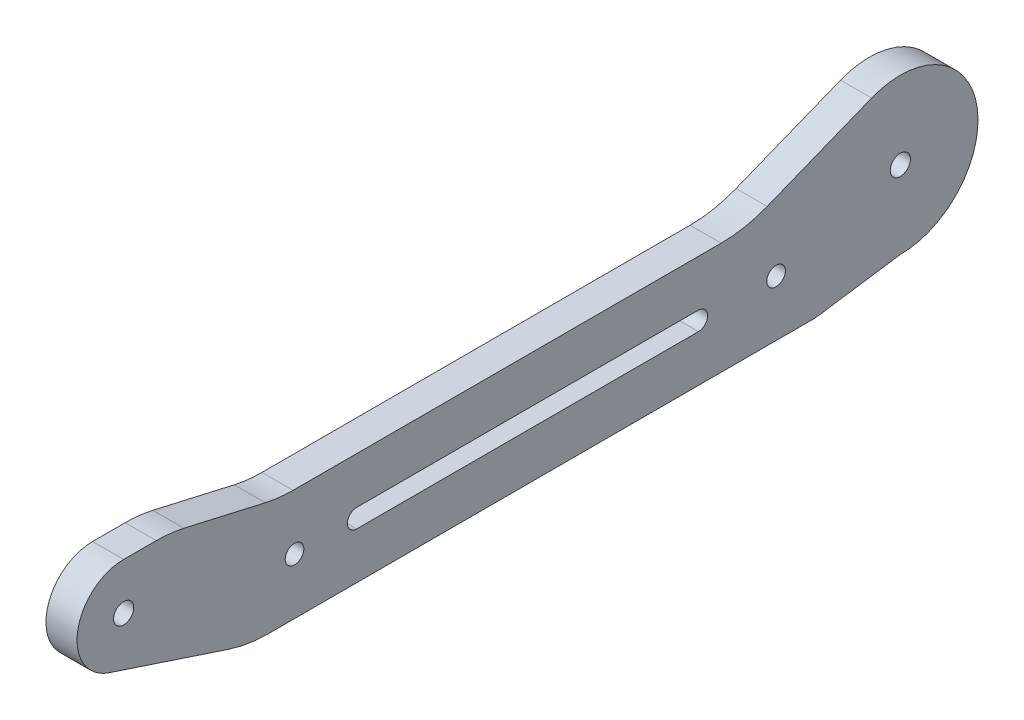
ISO-10303-21;
HEADER;
FILE_DESCRIPTION(('STEP AP214'),'2;1');
FILE_NAME('part.step','',(''),(''),'','','');
FILE_SCHEMA(('AUTOMOTIVE_DESIGN { 1 0 10303 214 1 1 1 1 }'));
ENDSEC;
DATA;
#1=APPLICATION_CONTEXT('core data for automotive mechanical design processes');
#2=APPLICATION_PROTOCOL_DEFINITION('international standard','automotive_design',2000,#1);
#3=PRODUCT_CONTEXT('',#1,'mechanical');
#4=PRODUCT('Part','Part','',(#3));
#5=PRODUCT_RELATED_PRODUCT_CATEGORY('part','',(#4));
#6=PRODUCT_DEFINITION_FORMATION('','',#4);
#7=PRODUCT_DEFINITION_CONTEXT('part definition',#1,'design');
#8=PRODUCT_DEFINITION('design','',#6,#7);
#9=PRODUCT_DEFINITION_SHAPE('','',#8);
#10=(LENGTH_UNIT() NAMED_UNIT(*) SI_UNIT(.MILLI.,.METRE.));
#11=(NAMED_UNIT(*) PLANE_ANGLE_UNIT() SI_UNIT($,.RADIAN.));
#12=(NAMED_UNIT(*) SI_UNIT($,.STERADIAN.) SOLID_ANGLE_UNIT());
#13=UNCERTAINTY_MEASURE_WITH_UNIT(LENGTH_MEASURE(1.E-05),#10,'distance_accuracy_value','');
#14=(GEOMETRIC_REPRESENTATION_CONTEXT(3) GLOBAL_UNCERTAINTY_ASSIGNED_CONTEXT((#13)) GLOBAL_UNIT_ASSIGNED_CONTEXT((#10,
#11,#12)) REPRESENTATION_CONTEXT('',''));
#15=CARTESIAN_POINT('',(0.,0.,0.));
#16=DIRECTION('',(0.,0.,1.));
#17=DIRECTION('',(1.,0.,0.));
#18=AXIS2_PLACEMENT_3D('',#15,#16,#17);
#19=CARTESIAN_POINT('',(2.5,0.,0.));
#20=DIRECTION('',(1.,0.,0.));
#21=DIRECTION('',(0.,0.,-1.));
#22=AXIS2_PLACEMENT_3D('',#19,#20,#21);
#23=PLANE('',#22);
#24=CARTESIAN_POINT('',(2.5,0.,125.));
#25=DIRECTION('',(-1.,0.,0.));
#26=DIRECTION('',(0.,0.,1.));
#27=AXIS2_PLACEMENT_3D('',#24,#25,#26);
#28=CIRCLE('',#27,1.62500000000002);
#29=CARTESIAN_POINT('',(2.5,0.,126.625));
#30=VERTEX_POINT('',#29);
#31=EDGE_CURVE('E232',#30,#30,#28,.T.);
#32=ORIENTED_EDGE('',*,*,#31,.T.);
#33=EDGE_LOOP('',(#32));
#34=FACE_BOUND('',#33,.T.);
#35=CARTESIAN_POINT('',(2.5,-5.50000000000001,97.5));
#36=DIRECTION('',(-1.,0.,0.));
#37=DIRECTION('',(0.,0.,1.));
#38=AXIS2_PLACEMENT_3D('',#35,#36,#37);
#39=CIRCLE('',#38,1.5);
#40=CARTESIAN_POINT('',(2.5,-5.50000000000001,99.));
#41=VERTEX_POINT('',#40);
#42=EDGE_CURVE('E235',#41,#41,#39,.T.);
#43=ORIENTED_EDGE('',*,*,#42,.T.);
#44=EDGE_LOOP('',(#43));
#45=FACE_BOUND('',#44,.T.);
#46=CARTESIAN_POINT('',(2.5,-5.5,20.));
#47=DIRECTION('',(-1.,0.,0.));
#48=DIRECTION('',(0.,0.,1.));
#49=AXIS2_PLACEMENT_3D('',#46,#47,#48);
#50=CIRCLE('',#49,1.5);
#51=CARTESIAN_POINT('',(2.5,-5.5,21.5));
#52=VERTEX_POINT('',#51);
#53=EDGE_CURVE('E238',#52,#52,#50,.T.);
#54=ORIENTED_EDGE('',*,*,#53,.T.);
#55=EDGE_LOOP('',(#54));
#56=FACE_BOUND('',#55,.T.);
#57=CARTESIAN_POINT('',(2.5,-5.5,87.5));
#58=DIRECTION('',(-1.,0.,0.));
#59=DIRECTION('',(0.,0.,1.));
#60=AXIS2_PLACEMENT_3D('',#57,#58,#59);
#61=CIRCLE('',#60,1.5);
#62=CARTESIAN_POINT('',(2.5,-7.,87.5));
#63=VERTEX_POINT('',#62);
#64=CARTESIAN_POINT('',(2.5,-4.,87.5));
#65=VERTEX_POINT('',#64);
#66=EDGE_CURVE('E245',#63,#65,#61,.T.);
#67=ORIENTED_EDGE('',*,*,#66,.T.);
#68=DIRECTION('',(0.,0.,1.));
#69=VECTOR('',#68,1.);
#70=CARTESIAN_POINT('',(2.5,-3.99999999999998,0.));
#71=LINE('',#70,#69);
#72=CARTESIAN_POINT('',(2.5,-3.99999999999999,32.5));
#73=VERTEX_POINT('',#72);
#74=EDGE_CURVE('E164',#65,#73,#71,.F.);
#75=ORIENTED_EDGE('',*,*,#74,.T.);
#76=CARTESIAN_POINT('',(2.5,-5.49999999999999,32.5));
#77=DIRECTION('',(-1.,0.,0.));
#78=DIRECTION('',(0.,0.,1.));
#79=AXIS2_PLACEMENT_3D('',#76,#77,#78);
#80=CIRCLE('',#79,1.5);
#81=CARTESIAN_POINT('',(2.5,-6.99999999999999,32.5));
#82=VERTEX_POINT('',#81);
#83=EDGE_CURVE('E242',#73,#82,#80,.T.);
#84=ORIENTED_EDGE('',*,*,#83,.T.);
#85=DIRECTION('',(0.,0.,1.));
#86=VECTOR('',#85,1.);
#87=CARTESIAN_POINT('',(2.5,-6.99999999999998,0.));
#88=LINE('',#87,#86);
#89=EDGE_CURVE('E160',#63,#82,#88,.F.);
#90=ORIENTED_EDGE('',*,*,#89,.F.);
#91=EDGE_LOOP('',(#67,#75,#84,#90));
#92=FACE_BOUND('',#91,.T.);
#93=DIRECTION('',(0.,0.,1.));
#94=VECTOR('',#93,1.);
#95=CARTESIAN_POINT('',(2.5,3.5,0.));
#96=LINE('',#95,#94);
#97=CARTESIAN_POINT('',(2.5,3.5,97.7433846449188));
#98=VERTEX_POINT('',#97);
#99=CARTESIAN_POINT('',(2.5,3.5,28.8353597506734));
#100=VERTEX_POINT('',#99);
#101=EDGE_CURVE('E174',#98,#100,#96,.F.);
#102=ORIENTED_EDGE('',*,*,#101,.F.);
#103=CARTESIAN_POINT('',(2.5,23.5,97.7433846449188));
#104=DIRECTION('',(1.,0.,0.));
#105=DIRECTION('',(0.,0.,-1.));
#106=AXIS2_PLACEMENT_3D('',#103,#104,#105);
#107=CIRCLE('',#106,20.);
#108=CARTESIAN_POINT('',(2.5,4.00282986856266,102.199880674962));
#109=VERTEX_POINT('',#108);
#110=EDGE_CURVE('E173',#98,#109,#107,.F.);
#111=ORIENTED_EDGE('',*,*,#110,.T.);
#112=DIRECTION('',(0.,0.222824801502141,0.974858506571867));
#113=VECTOR('',#112,1.);
#114=CARTESIAN_POINT('',(2.5,-18.3960434445307,4.20480993017844));
#115=LINE('',#114,#113);
#116=CARTESIAN_POINT('',(2.5,6.99717013143735,115.300119325038));
#117=VERTEX_POINT('',#116);
#118=EDGE_CURVE('E170',#117,#109,#115,.F.);
#119=ORIENTED_EDGE('',*,*,#118,.F.);
#120=CARTESIAN_POINT('',(2.5,-12.5,119.756615355081));
#121=DIRECTION('',(-1.,0.,0.));
#122=DIRECTION('',(0.,0.,1.));
#123=AXIS2_PLACEMENT_3D('',#120,#121,#122);
#124=CIRCLE('',#123,20.);
#125=CARTESIAN_POINT('',(2.5,7.5,119.756615355081));
#126=VERTEX_POINT('',#125);
#127=EDGE_CURVE('E247',#126,#117,#124,.T.);
#128=ORIENTED_EDGE('',*,*,#127,.F.);
#129=DIRECTION('',(0.,0.,1.));
#130=VECTOR('',#129,1.);
#131=CARTESIAN_POINT('',(2.5,7.4999999999998,0.));
#132=LINE('',#131,#130);
#133=CARTESIAN_POINT('',(2.5,7.50000000000001,125.));
#134=VERTEX_POINT('',#133);
#135=EDGE_CURVE('E148',#134,#126,#132,.F.);
#136=ORIENTED_EDGE('',*,*,#135,.F.);
#137=CARTESIAN_POINT('',(2.5,0.,125.));
#138=DIRECTION('',(-1.,0.,0.));
#139=DIRECTION('',(0.,0.,1.));
#140=AXIS2_PLACEMENT_3D('',#137,#138,#139);
#141=CIRCLE('',#140,7.50000000000001);
#142=CARTESIAN_POINT('',(2.5,-7.12200850271521,127.350956164468));
#143=VERTEX_POINT('',#142);
#144=EDGE_CURVE('E142',#143,#134,#141,.T.);
#145=ORIENTED_EDGE('',*,*,#144,.F.);
#146=DIRECTION('',(0.,-0.313460821929135,-0.949601133695359));
#147=VECTOR('',#146,1.);
#148=CARTESIAN_POINT('',(2.5,-44.3298524868384,14.6331670250296));
#149=LINE('',#148,#147);
#150=CARTESIAN_POINT('',(2.5,-13.4920226739072,108.05357590051));
#151=VERTEX_POINT('',#150);
#152=EDGE_CURVE('E133',#151,#143,#149,.F.);
#153=ORIENTED_EDGE('',*,*,#152,.F.);
#154=CARTESIAN_POINT('',(2.5,5.5,101.784359461928));
#155=DIRECTION('',(1.,0.,0.));
#156=DIRECTION('',(0.,0.,-1.));
#157=AXIS2_PLACEMENT_3D('',#154,#155,#156);
#158=CIRCLE('',#157,20.);
#159=CARTESIAN_POINT('',(2.5,-14.5,101.784359461928));
#160=VERTEX_POINT('',#159);
#161=EDGE_CURVE('E154',#160,#151,#158,.F.);
#162=ORIENTED_EDGE('',*,*,#161,.F.);
#163=DIRECTION('',(0.,0.,1.));
#164=VECTOR('',#163,1.);
#165=CARTESIAN_POINT('',(2.5,-14.5,0.));
#166=LINE('',#165,#164);
#167=CARTESIAN_POINT('',(2.5,-14.5,13.675));
#168=VERTEX_POINT('',#167);
#169=EDGE_CURVE('E189',#160,#168,#166,.F.);
#170=ORIENTED_EDGE('',*,*,#169,.T.);
#171=DIRECTION('',(0.,-0.144712790159397,0.989473702714874));
#172=VECTOR('',#171,1.);
#173=CARTESIAN_POINT('',(2.5,-12.2382276045535,-1.78986875386523));
#174=LINE('',#173,#172);
#175=CARTESIAN_POINT('',(2.5,-12.5,0.));
#176=VERTEX_POINT('',#175);
#177=EDGE_CURVE('E182',#168,#176,#174,.F.);
#178=ORIENTED_EDGE('',*,*,#177,.T.);
#179=CARTESIAN_POINT('',(2.5,0.,0.));
#180=DIRECTION('',(-1.,0.,0.));
#181=DIRECTION('',(0.,0.,1.));
#182=AXIS2_PLACEMENT_3D('',#179,#180,#181);
#183=CIRCLE('',#182,12.5);
#184=CARTESIAN_POINT('',(2.5,11.6132366611717,4.62414686743597));
#185=VERTEX_POINT('',#184);
#186=EDGE_CURVE('E185',#185,#176,#183,.T.);
#187=ORIENTED_EDGE('',*,*,#186,.F.);
#188=DIRECTION('',(0.,-0.369931749394877,0.929058932893735));
#189=VECTOR('',#188,1.);
#190=CARTESIAN_POINT('',(2.5,11.6132366611717,4.62414686743597));
#191=LINE('',#190,#189);
#192=CARTESIAN_POINT('',(2.5,4.9188213421253,21.4367247627758));
#193=VERTEX_POINT('',#192);
#194=EDGE_CURVE('E178',#193,#185,#191,.F.);
#195=ORIENTED_EDGE('',*,*,#194,.F.);
#196=CARTESIAN_POINT('',(2.5,23.5,28.8353597506734));
#197=DIRECTION('',(1.,0.,0.));
#198=DIRECTION('',(0.,0.,-1.));
#199=AXIS2_PLACEMENT_3D('',#196,#197,#198);
#200=CIRCLE('',#199,20.);
#201=EDGE_CURVE('E177',#193,#100,#200,.F.);
#202=ORIENTED_EDGE('',*,*,#201,.T.);
#203=EDGE_LOOP('',(#102,#111,#119,#128,#136,#145,#153,#162,#170,#178,#187,#195,#202));
#204=FACE_BOUND('',#203,.T.);
#205=CARTESIAN_POINT('',(2.5,0.,0.));
#206=DIRECTION('',(-1.,0.,0.));
#207=DIRECTION('',(0.,0.,1.));
#208=AXIS2_PLACEMENT_3D('',#205,#206,#207);
#209=CIRCLE('',#208,1.625);
#210=CARTESIAN_POINT('',(2.5,0.,1.625));
#211=VERTEX_POINT('',#210);
#212=EDGE_CURVE('E20',#211,#211,#209,.T.);
#213=ORIENTED_EDGE('',*,*,#212,.T.);
#214=EDGE_LOOP('',(#213));
#215=FACE_BOUND('',#214,.T.);
#216=ADVANCED_FACE('F17',(#34,#45,#56,#92,#204,#215),#23,.T.);
#217=CARTESIAN_POINT('',(2.5,0.,0.));
#218=DIRECTION('',(-1.,0.,0.));
#219=DIRECTION('',(0.,0.,1.));
#220=AXIS2_PLACEMENT_3D('',#217,#218,#219);
#221=CYLINDRICAL_SURFACE('',#220,1.625);
#222=CARTESIAN_POINT('',(-2.5,0.,0.));
#223=DIRECTION('',(-1.,0.,0.));
#224=DIRECTION('',(0.,0.,1.));
#225=AXIS2_PLACEMENT_3D('',#222,#223,#224);
#226=CIRCLE('',#225,1.625);
#227=CARTESIAN_POINT('',(-2.5,0.,1.625));
#228=VERTEX_POINT('',#227);
#229=EDGE_CURVE('E229',#228,#228,#226,.T.);
#230=ORIENTED_EDGE('',*,*,#229,.T.);
#231=EDGE_LOOP('',(#230));
#232=FACE_BOUND('',#231,.T.);
#233=ORIENTED_EDGE('',*,*,#212,.F.);
#234=EDGE_LOOP('',(#233));
#235=FACE_BOUND('',#234,.T.);
#236=ADVANCED_FACE('F406',(#232,#235),#221,.F.);
#237=CARTESIAN_POINT('',(2.5,0.,125.));
#238=DIRECTION('',(-1.,0.,0.));
#239=DIRECTION('',(0.,0.,1.));
#240=AXIS2_PLACEMENT_3D('',#237,#238,#239);
#241=CYLINDRICAL_SURFACE('',#240,7.50000000000001);
#242=CARTESIAN_POINT('',(-2.5,0.,125.));
#243=DIRECTION('',(-1.,0.,0.));
#244=DIRECTION('',(0.,0.,1.));
#245=AXIS2_PLACEMENT_3D('',#242,#243,#244);
#246=CIRCLE('',#245,7.50000000000001);
#247=CARTESIAN_POINT('',(-2.5,7.50000000000001,125.));
#248=VERTEX_POINT('',#247);
#249=CARTESIAN_POINT('',(-2.5,-7.1220085027152,127.350956164469));
#250=VERTEX_POINT('',#249);
#251=EDGE_CURVE('E153',#248,#250,#246,.F.);
#252=ORIENTED_EDGE('',*,*,#251,.T.);
#253=DIRECTION('',(1.,0.,0.));
#254=VECTOR('',#253,1.);
#255=CARTESIAN_POINT('',(2.5,-7.12200850271521,127.350956164468));
#256=LINE('',#255,#254);
#257=EDGE_CURVE('E138',#143,#250,#256,.F.);
#258=ORIENTED_EDGE('',*,*,#257,.F.);
#259=ORIENTED_EDGE('',*,*,#144,.T.);
#260=DIRECTION('',(1.,0.,0.));
#261=VECTOR('',#260,1.);
#262=CARTESIAN_POINT('',(2.5,7.50000000000001,125.));
#263=LINE('',#262,#261);
#264=EDGE_CURVE('E163',#248,#134,#263,.T.);
#265=ORIENTED_EDGE('',*,*,#264,.F.);
#266=EDGE_LOOP('',(#252,#258,#259,#265));
#267=FACE_BOUND('',#266,.T.);
#268=ADVANCED_FACE('F152',(#267),#241,.T.);
#269=CARTESIAN_POINT('',(2.5,-44.3298524868384,14.6331670250296));
#270=DIRECTION('',(0.,-0.949601133695359,0.313460821929135));
#271=DIRECTION('',(0.,-0.313460821929135,-0.949601133695359));
#272=AXIS2_PLACEMENT_3D('',#269,#270,#271);
#273=PLANE('',#272);
#274=ORIENTED_EDGE('',*,*,#152,.T.);
#275=ORIENTED_EDGE('',*,*,#257,.T.);
#276=DIRECTION('',(0.,-0.313460821929135,-0.949601133695359));
#277=VECTOR('',#276,1.);
#278=CARTESIAN_POINT('',(-2.5,-7.12200850271521,127.350956164468));
#279=LINE('',#278,#277);
#280=CARTESIAN_POINT('',(-2.5,-13.4920226739072,108.05357590051));
#281=VERTEX_POINT('',#280);
#282=EDGE_CURVE('E227',#250,#281,#279,.T.);
#283=ORIENTED_EDGE('',*,*,#282,.T.);
#284=DIRECTION('',(1.,0.,0.));
#285=VECTOR('',#284,1.);
#286=CARTESIAN_POINT('',(2.5,-13.4920226739072,108.05357590051));
#287=LINE('',#286,#285);
#288=EDGE_CURVE('E140',#151,#281,#287,.F.);
#289=ORIENTED_EDGE('',*,*,#288,.F.);
#290=EDGE_LOOP('',(#274,#275,#283,#289));
#291=FACE_BOUND('',#290,.T.);
#292=ADVANCED_FACE('F135',(#291),#273,.T.);
#293=CARTESIAN_POINT('',(2.5,5.5,101.784359461928));
#294=DIRECTION('',(1.,0.,0.));
#295=DIRECTION('',(0.,0.,-1.));
#296=AXIS2_PLACEMENT_3D('',#293,#294,#295);
#297=CYLINDRICAL_SURFACE('',#296,20.);
#298=CARTESIAN_POINT('',(-2.5,5.5,101.784359461928));
#299=DIRECTION('',(1.,0.,0.));
#300=DIRECTION('',(0.,0.,-1.));
#301=AXIS2_PLACEMENT_3D('',#298,#299,#300);
#302=CIRCLE('',#301,20.);
#303=CARTESIAN_POINT('',(-2.5,-14.5,101.784359461928));
#304=VERTEX_POINT('',#303);
#305=EDGE_CURVE('E223',#281,#304,#302,.T.);
#306=ORIENTED_EDGE('',*,*,#305,.T.);
#307=DIRECTION('',(1.,0.,0.));
#308=VECTOR('',#307,1.);
#309=CARTESIAN_POINT('',(2.5,-14.5,101.784359461928));
#310=LINE('',#309,#308);
#311=EDGE_CURVE('E192',#304,#160,#310,.T.);
#312=ORIENTED_EDGE('',*,*,#311,.T.);
#313=ORIENTED_EDGE('',*,*,#161,.T.);
#314=ORIENTED_EDGE('',*,*,#288,.T.);
#315=EDGE_LOOP('',(#306,#312,#313,#314));
#316=FACE_BOUND('',#315,.T.);
#317=ADVANCED_FACE('F270',(#316),#297,.T.);
#318=CARTESIAN_POINT('',(2.5,-14.5,0.));
#319=DIRECTION('',(0.,1.,0.));
#320=DIRECTION('',(0.,0.,1.));
#321=AXIS2_PLACEMENT_3D('',#318,#319,#320);
#322=PLANE('',#321);
#323=ORIENTED_EDGE('',*,*,#311,.F.);
#324=DIRECTION('',(0.,0.,-1.));
#325=VECTOR('',#324,1.);
#326=CARTESIAN_POINT('',(-2.5,-14.5,0.));
#327=LINE('',#326,#325);
#328=CARTESIAN_POINT('',(-2.5,-14.5,13.6749999999999));
#329=VERTEX_POINT('',#328);
#330=EDGE_CURVE('E226',#304,#329,#327,.T.);
#331=ORIENTED_EDGE('',*,*,#330,.T.);
#332=DIRECTION('',(1.,0.,0.));
#333=VECTOR('',#332,1.);
#334=CARTESIAN_POINT('',(2.5,-14.5,13.675));
#335=LINE('',#334,#333);
#336=EDGE_CURVE('E186',#329,#168,#335,.T.);
#337=ORIENTED_EDGE('',*,*,#336,.T.);
#338=ORIENTED_EDGE('',*,*,#169,.F.);
#339=EDGE_LOOP('',(#323,#331,#337,#338));
#340=FACE_BOUND('',#339,.T.);
#341=ADVANCED_FACE('F316',(#340),#322,.F.);
#342=CARTESIAN_POINT('',(2.5,-12.2382276045535,-1.78986875386523));
#343=DIRECTION('',(0.,0.989473702714874,0.144712790159397));
#344=DIRECTION('',(0.,-0.144712790159397,0.989473702714874));
#345=AXIS2_PLACEMENT_3D('',#342,#343,#344);
#346=PLANE('',#345);
#347=DIRECTION('',(-1.,0.,0.));
#348=VECTOR('',#347,1.);
#349=CARTESIAN_POINT('',(2.5,-12.5,0.));
#350=LINE('',#349,#348);
#351=CARTESIAN_POINT('',(-2.5,-12.5,0.));
#352=VERTEX_POINT('',#351);
#353=EDGE_CURVE('E181',#176,#352,#350,.T.);
#354=ORIENTED_EDGE('',*,*,#353,.F.);
#355=ORIENTED_EDGE('',*,*,#177,.F.);
#356=ORIENTED_EDGE('',*,*,#336,.F.);
#357=DIRECTION('',(0.,0.144712790159397,-0.989473702714874));
#358=VECTOR('',#357,1.);
#359=CARTESIAN_POINT('',(-2.5,-14.5,13.675));
#360=LINE('',#359,#358);
#361=EDGE_CURVE('E222',#329,#352,#360,.T.);
#362=ORIENTED_EDGE('',*,*,#361,.T.);
#363=EDGE_LOOP('',(#354,#355,#356,#362));
#364=FACE_BOUND('',#363,.T.);
#365=ADVANCED_FACE('F307',(#364),#346,.F.);
#366=CARTESIAN_POINT('',(2.5,0.,0.));
#367=DIRECTION('',(-1.,0.,0.));
#368=DIRECTION('',(0.,0.,1.));
#369=AXIS2_PLACEMENT_3D('',#366,#367,#368);
#370=CYLINDRICAL_SURFACE('',#369,12.5);
#371=ORIENTED_EDGE('',*,*,#186,.T.);
#372=ORIENTED_EDGE('',*,*,#353,.T.);
#373=CARTESIAN_POINT('',(-2.5,0.,0.));
#374=DIRECTION('',(-1.,0.,0.));
#375=DIRECTION('',(0.,0.,1.));
#376=AXIS2_PLACEMENT_3D('',#373,#374,#375);
#377=CIRCLE('',#376,12.5);
#378=CARTESIAN_POINT('',(-2.5,11.6132366611717,4.62414686743597));
#379=VERTEX_POINT('',#378);
#380=EDGE_CURVE('E219',#352,#379,#377,.F.);
#381=ORIENTED_EDGE('',*,*,#380,.T.);
#382=DIRECTION('',(1.,0.,0.));
#383=VECTOR('',#382,1.);
#384=CARTESIAN_POINT('',(2.5,11.6132366611717,4.62414686743597));
#385=LINE('',#384,#383);
#386=EDGE_CURVE('E180',#185,#379,#385,.F.);
#387=ORIENTED_EDGE('',*,*,#386,.F.);
#388=EDGE_LOOP('',(#371,#372,#381,#387));
#389=FACE_BOUND('',#388,.T.);
#390=ADVANCED_FACE('F305',(#389),#370,.T.);
#391=CARTESIAN_POINT('',(2.5,11.6132366611717,4.62414686743597));
#392=DIRECTION('',(0.,0.929058932893735,0.369931749394877));
#393=DIRECTION('',(0.,-0.369931749394877,0.929058932893735));
#394=AXIS2_PLACEMENT_3D('',#391,#392,#393);
#395=PLANE('',#394);
#396=ORIENTED_EDGE('',*,*,#194,.T.);
#397=ORIENTED_EDGE('',*,*,#386,.T.);
#398=DIRECTION('',(0.,-0.369931749394877,0.929058932893735));
#399=VECTOR('',#398,1.);
#400=CARTESIAN_POINT('',(-2.5,11.6132366611717,4.62414686743596));
#401=LINE('',#400,#399);
#402=CARTESIAN_POINT('',(-2.5,4.9188213421253,21.4367247627758));
#403=VERTEX_POINT('',#402);
#404=EDGE_CURVE('E218',#379,#403,#401,.T.);
#405=ORIENTED_EDGE('',*,*,#404,.T.);
#406=DIRECTION('',(1.,0.,0.));
#407=VECTOR('',#406,1.);
#408=CARTESIAN_POINT('',(2.5,4.91882134212529,21.4367247627758));
#409=LINE('',#408,#407);
#410=EDGE_CURVE('E254',#403,#193,#409,.T.);
#411=ORIENTED_EDGE('',*,*,#410,.T.);
#412=EDGE_LOOP('',(#396,#397,#405,#411));
#413=FACE_BOUND('',#412,.T.);
#414=ADVANCED_FACE('F300',(#413),#395,.T.);
#415=CARTESIAN_POINT('',(2.5,23.5,28.8353597506734));
#416=DIRECTION('',(1.,0.,0.));
#417=DIRECTION('',(0.,0.,-1.));
#418=AXIS2_PLACEMENT_3D('',#415,#416,#417);
#419=CYLINDRICAL_SURFACE('',#418,20.);
#420=ORIENTED_EDGE('',*,*,#410,.F.);
#421=CARTESIAN_POINT('',(-2.5,23.5,28.8353597506734));
#422=DIRECTION('',(1.,0.,0.));
#423=DIRECTION('',(0.,0.,-1.));
#424=AXIS2_PLACEMENT_3D('',#421,#422,#423);
#425=CIRCLE('',#424,20.);
#426=CARTESIAN_POINT('',(-2.5,3.5,28.8353597506734));
#427=VERTEX_POINT('',#426);
#428=EDGE_CURVE('E215',#403,#427,#425,.F.);
#429=ORIENTED_EDGE('',*,*,#428,.T.);
#430=DIRECTION('',(1.,0.,0.));
#431=VECTOR('',#430,1.);
#432=CARTESIAN_POINT('',(2.5,3.5,28.8353597506734));
#433=LINE('',#432,#431);
#434=EDGE_CURVE('E176',#100,#427,#433,.F.);
#435=ORIENTED_EDGE('',*,*,#434,.F.);
#436=ORIENTED_EDGE('',*,*,#201,.F.);
#437=EDGE_LOOP('',(#420,#429,#435,#436));
#438=FACE_BOUND('',#437,.T.);
#439=ADVANCED_FACE('F314',(#438),#419,.F.);
#440=CARTESIAN_POINT('',(2.5,3.5,0.));
#441=DIRECTION('',(0.,1.,0.));
#442=DIRECTION('',(0.,0.,1.));
#443=AXIS2_PLACEMENT_3D('',#440,#441,#442);
#444=PLANE('',#443);
#445=ORIENTED_EDGE('',*,*,#101,.T.);
#446=ORIENTED_EDGE('',*,*,#434,.T.);
#447=DIRECTION('',(0.,0.,-1.));
#448=VECTOR('',#447,1.);
#449=CARTESIAN_POINT('',(-2.5,3.5,0.));
#450=LINE('',#449,#448);
#451=CARTESIAN_POINT('',(-2.5,3.5,97.7433846449188));
#452=VERTEX_POINT('',#451);
#453=EDGE_CURVE('E214',#427,#452,#450,.F.);
#454=ORIENTED_EDGE('',*,*,#453,.T.);
#455=DIRECTION('',(1.,0.,0.));
#456=VECTOR('',#455,1.);
#457=CARTESIAN_POINT('',(2.5,3.5,97.7433846449188));
#458=LINE('',#457,#456);
#459=EDGE_CURVE('E251',#452,#98,#458,.T.);
#460=ORIENTED_EDGE('',*,*,#459,.T.);
#461=EDGE_LOOP('',(#445,#446,#454,#460));
#462=FACE_BOUND('',#461,.T.);
#463=ADVANCED_FACE('F369',(#462),#444,.T.);
#464=CARTESIAN_POINT('',(2.5,23.5,97.7433846449188));
#465=DIRECTION('',(1.,0.,0.));
#466=DIRECTION('',(0.,0.,-1.));
#467=AXIS2_PLACEMENT_3D('',#464,#465,#466);
#468=CYLINDRICAL_SURFACE('',#467,20.);
#469=ORIENTED_EDGE('',*,*,#459,.F.);
#470=CARTESIAN_POINT('',(-2.5,23.5,97.7433846449188));
#471=DIRECTION('',(1.,0.,0.));
#472=DIRECTION('',(0.,0.,-1.));
#473=AXIS2_PLACEMENT_3D('',#470,#471,#472);
#474=CIRCLE('',#473,20.);
#475=CARTESIAN_POINT('',(-2.5,4.00282986856266,102.199880674962));
#476=VERTEX_POINT('',#475);
#477=EDGE_CURVE('E211',#452,#476,#474,.F.);
#478=ORIENTED_EDGE('',*,*,#477,.T.);
#479=DIRECTION('',(1.,0.,0.));
#480=VECTOR('',#479,1.);
#481=CARTESIAN_POINT('',(2.5,4.00282986856267,102.199880674962));
#482=LINE('',#481,#480);
#483=EDGE_CURVE('E172',#109,#476,#482,.F.);
#484=ORIENTED_EDGE('',*,*,#483,.F.);
#485=ORIENTED_EDGE('',*,*,#110,.F.);
#486=EDGE_LOOP('',(#469,#478,#484,#485));
#487=FACE_BOUND('',#486,.T.);
#488=ADVANCED_FACE('F365',(#487),#468,.F.);
#489=CARTESIAN_POINT('',(2.5,-18.3960434445307,4.20480993017844));
#490=DIRECTION('',(0.,0.974858506571867,-0.222824801502141));
#491=DIRECTION('',(0.,0.222824801502141,0.974858506571867));
#492=AXIS2_PLACEMENT_3D('',#489,#490,#491);
#493=PLANE('',#492);
#494=ORIENTED_EDGE('',*,*,#118,.T.);
#495=ORIENTED_EDGE('',*,*,#483,.T.);
#496=DIRECTION('',(0.,0.222824801502141,0.974858506571867));
#497=VECTOR('',#496,1.);
#498=CARTESIAN_POINT('',(-2.5,4.00282986856266,102.199880674962));
#499=LINE('',#498,#497);
#500=CARTESIAN_POINT('',(-2.5,6.99717013143735,115.300119325038));
#501=VERTEX_POINT('',#500);
#502=EDGE_CURVE('E210',#476,#501,#499,.T.);
#503=ORIENTED_EDGE('',*,*,#502,.T.);
#504=DIRECTION('',(-1.,0.,0.));
#505=VECTOR('',#504,1.);
#506=CARTESIAN_POINT('',(2.5,6.99717013143735,115.300119325038));
#507=LINE('',#506,#505);
#508=EDGE_CURVE('E169',#117,#501,#507,.T.);
#509=ORIENTED_EDGE('',*,*,#508,.F.);
#510=EDGE_LOOP('',(#494,#495,#503,#509));
#511=FACE_BOUND('',#510,.T.);
#512=ADVANCED_FACE('F361',(#511),#493,.T.);
#513=CARTESIAN_POINT('',(2.5,-12.5,119.756615355081));
#514=DIRECTION('',(-1.,0.,0.));
#515=DIRECTION('',(0.,0.,1.));
#516=AXIS2_PLACEMENT_3D('',#513,#514,#515);
#517=CYLINDRICAL_SURFACE('',#516,20.);
#518=CARTESIAN_POINT('',(-2.5,-12.5,119.756615355081));
#519=DIRECTION('',(-1.,0.,0.));
#520=DIRECTION('',(0.,0.,1.));
#521=AXIS2_PLACEMENT_3D('',#518,#519,#520);
#522=CIRCLE('',#521,20.);
#523=CARTESIAN_POINT('',(-2.5,7.50000000000001,119.756615355081));
#524=VERTEX_POINT('',#523);
#525=EDGE_CURVE('E206',#501,#524,#522,.F.);
#526=ORIENTED_EDGE('',*,*,#525,.T.);
#527=DIRECTION('',(1.,0.,0.));
#528=VECTOR('',#527,1.);
#529=CARTESIAN_POINT('',(2.5,7.5,119.756615355081));
#530=LINE('',#529,#528);
#531=EDGE_CURVE('E168',#126,#524,#530,.F.);
#532=ORIENTED_EDGE('',*,*,#531,.F.);
#533=ORIENTED_EDGE('',*,*,#127,.T.);
#534=ORIENTED_EDGE('',*,*,#508,.T.);
#535=EDGE_LOOP('',(#526,#532,#533,#534));
#536=FACE_BOUND('',#535,.T.);
#537=ADVANCED_FACE('F357',(#536),#517,.T.);
#538=CARTESIAN_POINT('',(2.5,7.4999999999998,0.));
#539=DIRECTION('',(0.,1.,0.));
#540=DIRECTION('',(0.,0.,1.));
#541=AXIS2_PLACEMENT_3D('',#538,#539,#540);
#542=PLANE('',#541);
#543=DIRECTION('',(0.,0.,-1.));
#544=VECTOR('',#543,1.);
#545=CARTESIAN_POINT('',(-2.5,7.50000000000001,0.));
#546=LINE('',#545,#544);
#547=EDGE_CURVE('E209',#524,#248,#546,.F.);
#548=ORIENTED_EDGE('',*,*,#547,.T.);
#549=ORIENTED_EDGE('',*,*,#264,.T.);
#550=ORIENTED_EDGE('',*,*,#135,.T.);
#551=ORIENTED_EDGE('',*,*,#531,.T.);
#552=EDGE_LOOP('',(#548,#549,#550,#551));
#553=FACE_BOUND('',#552,.T.);
#554=ADVANCED_FACE('F353',(#553),#542,.T.);
#555=CARTESIAN_POINT('',(2.5,-6.99999999999998,0.));
#556=DIRECTION('',(0.,1.,0.));
#557=DIRECTION('',(0.,0.,1.));
#558=AXIS2_PLACEMENT_3D('',#555,#556,#557);
#559=PLANE('',#558);
#560=ORIENTED_EDGE('',*,*,#89,.T.);
#561=DIRECTION('',(-1.,0.,0.));
#562=VECTOR('',#561,1.);
#563=CARTESIAN_POINT('',(2.5,-6.99999999999999,32.5));
#564=LINE('',#563,#562);
#565=CARTESIAN_POINT('',(-2.5,-6.99999999999999,32.5));
#566=VERTEX_POINT('',#565);
#567=EDGE_CURVE('E241',#82,#566,#564,.T.);
#568=ORIENTED_EDGE('',*,*,#567,.T.);
#569=DIRECTION('',(0.,0.,-1.));
#570=VECTOR('',#569,1.);
#571=CARTESIAN_POINT('',(-2.5,-6.99999999999999,0.));
#572=LINE('',#571,#570);
#573=CARTESIAN_POINT('',(-2.5,-6.99999999999999,87.5));
#574=VERTEX_POINT('',#573);
#575=EDGE_CURVE('E205',#566,#574,#572,.F.);
#576=ORIENTED_EDGE('',*,*,#575,.T.);
#577=DIRECTION('',(-1.,0.,0.));
#578=VECTOR('',#577,1.);
#579=CARTESIAN_POINT('',(2.5,-7.,87.5));
#580=LINE('',#579,#578);
#581=EDGE_CURVE('E162',#574,#63,#580,.F.);
#582=ORIENTED_EDGE('',*,*,#581,.T.);
#583=EDGE_LOOP('',(#560,#568,#576,#582));
#584=FACE_BOUND('',#583,.T.);
#585=ADVANCED_FACE('F349',(#584),#559,.T.);
#586=CARTESIAN_POINT('',(2.5,-5.5,87.5));
#587=DIRECTION('',(-1.,0.,0.));
#588=DIRECTION('',(0.,0.,1.));
#589=AXIS2_PLACEMENT_3D('',#586,#587,#588);
#590=CYLINDRICAL_SURFACE('',#589,1.5);
#591=ORIENTED_EDGE('',*,*,#66,.F.);
#592=ORIENTED_EDGE('',*,*,#581,.F.);
#593=CARTESIAN_POINT('',(-2.5,-5.5,87.5));
#594=DIRECTION('',(-1.,0.,0.));
#595=DIRECTION('',(0.,0.,1.));
#596=AXIS2_PLACEMENT_3D('',#593,#594,#595);
#597=CIRCLE('',#596,1.5);
#598=CARTESIAN_POINT('',(-2.5,-4.,87.5));
#599=VERTEX_POINT('',#598);
#600=EDGE_CURVE('E203',#574,#599,#597,.T.);
#601=ORIENTED_EDGE('',*,*,#600,.T.);
#602=DIRECTION('',(1.,0.,0.));
#603=VECTOR('',#602,1.);
#604=CARTESIAN_POINT('',(2.5,-4.,87.5));
#605=LINE('',#604,#603);
#606=EDGE_CURVE('E166',#599,#65,#605,.T.);
#607=ORIENTED_EDGE('',*,*,#606,.T.);
#608=EDGE_LOOP('',(#591,#592,#601,#607));
#609=FACE_BOUND('',#608,.T.);
#610=ADVANCED_FACE('F345',(#609),#590,.F.);
#611=CARTESIAN_POINT('',(2.5,-3.99999999999998,0.));
#612=DIRECTION('',(0.,1.,0.));
#613=DIRECTION('',(0.,0.,1.));
#614=AXIS2_PLACEMENT_3D('',#611,#612,#613);
#615=PLANE('',#614);
#616=DIRECTION('',(-1.,0.,0.));
#617=VECTOR('',#616,1.);
#618=CARTESIAN_POINT('',(2.5,-3.99999999999999,32.5));
#619=LINE('',#618,#617);
#620=CARTESIAN_POINT('',(-2.5,-3.99999999999999,32.5));
#621=VERTEX_POINT('',#620);
#622=EDGE_CURVE('E35',#621,#73,#619,.F.);
#623=ORIENTED_EDGE('',*,*,#622,.T.);
#624=ORIENTED_EDGE('',*,*,#74,.F.);
#625=ORIENTED_EDGE('',*,*,#606,.F.);
#626=DIRECTION('',(0.,0.,-1.));
#627=VECTOR('',#626,1.);
#628=CARTESIAN_POINT('',(-2.5,-4.,0.));
#629=LINE('',#628,#627);
#630=EDGE_CURVE('E202',#599,#621,#629,.T.);
#631=ORIENTED_EDGE('',*,*,#630,.T.);
#632=EDGE_LOOP('',(#623,#624,#625,#631));
#633=FACE_BOUND('',#632,.T.);
#634=ADVANCED_FACE('F342',(#633),#615,.F.);
#635=CARTESIAN_POINT('',(2.5,-5.49999999999999,32.5));
#636=DIRECTION('',(-1.,0.,0.));
#637=DIRECTION('',(0.,0.,1.));
#638=AXIS2_PLACEMENT_3D('',#635,#636,#637);
#639=CYLINDRICAL_SURFACE('',#638,1.5);
#640=ORIENTED_EDGE('',*,*,#567,.F.);
#641=ORIENTED_EDGE('',*,*,#83,.F.);
#642=ORIENTED_EDGE('',*,*,#622,.F.);
#643=CARTESIAN_POINT('',(-2.5,-5.49999999999999,32.5));
#644=DIRECTION('',(-1.,0.,0.));
#645=DIRECTION('',(0.,0.,1.));
#646=AXIS2_PLACEMENT_3D('',#643,#644,#645);
#647=CIRCLE('',#646,1.5);
#648=EDGE_CURVE('E200',#621,#566,#647,.T.);
#649=ORIENTED_EDGE('',*,*,#648,.T.);
#650=EDGE_LOOP('',(#640,#641,#642,#649));
#651=FACE_BOUND('',#650,.T.);
#652=ADVANCED_FACE('F338',(#651),#639,.F.);
#653=CARTESIAN_POINT('',(2.5,-5.5,20.));
#654=DIRECTION('',(-1.,0.,0.));
#655=DIRECTION('',(0.,0.,1.));
#656=AXIS2_PLACEMENT_3D('',#653,#654,#655);
#657=CYLINDRICAL_SURFACE('',#656,1.5);
#658=CARTESIAN_POINT('',(-2.5,-5.5,20.));
#659=DIRECTION('',(-1.,0.,0.));
#660=DIRECTION('',(0.,0.,1.));
#661=AXIS2_PLACEMENT_3D('',#658,#659,#660);
#662=CIRCLE('',#661,1.5);
#663=CARTESIAN_POINT('',(-2.5,-5.5,21.5));
#664=VERTEX_POINT('',#663);
#665=EDGE_CURVE('E197',#664,#664,#662,.T.);
#666=ORIENTED_EDGE('',*,*,#665,.T.);
#667=EDGE_LOOP('',(#666));
#668=FACE_BOUND('',#667,.T.);
#669=ORIENTED_EDGE('',*,*,#53,.F.);
#670=EDGE_LOOP('',(#669));
#671=FACE_BOUND('',#670,.T.);
#672=ADVANCED_FACE('F334',(#668,#671),#657,.F.);
#673=CARTESIAN_POINT('',(2.5,-5.50000000000001,97.5));
#674=DIRECTION('',(-1.,0.,0.));
#675=DIRECTION('',(0.,0.,1.));
#676=AXIS2_PLACEMENT_3D('',#673,#674,#675);
#677=CYLINDRICAL_SURFACE('',#676,1.5);
#678=CARTESIAN_POINT('',(-2.5,-5.50000000000001,97.5));
#679=DIRECTION('',(-1.,0.,0.));
#680=DIRECTION('',(0.,0.,1.));
#681=AXIS2_PLACEMENT_3D('',#678,#679,#680);
#682=CIRCLE('',#681,1.5);
#683=CARTESIAN_POINT('',(-2.5,-5.50000000000001,99.));
#684=VERTEX_POINT('',#683);
#685=EDGE_CURVE('E26',#684,#684,#682,.T.);
#686=ORIENTED_EDGE('',*,*,#685,.T.);
#687=EDGE_LOOP('',(#686));
#688=FACE_BOUND('',#687,.T.);
#689=ORIENTED_EDGE('',*,*,#42,.F.);
#690=EDGE_LOOP('',(#689));
#691=FACE_BOUND('',#690,.T.);
#692=ADVANCED_FACE('F326',(#688,#691),#677,.F.);
#693=CARTESIAN_POINT('',(2.5,0.,125.));
#694=DIRECTION('',(-1.,0.,0.));
#695=DIRECTION('',(0.,0.,1.));
#696=AXIS2_PLACEMENT_3D('',#693,#694,#695);
#697=CYLINDRICAL_SURFACE('',#696,1.62500000000002);
#698=CARTESIAN_POINT('',(-2.5,0.,125.));
#699=DIRECTION('',(-1.,0.,0.));
#700=DIRECTION('',(0.,0.,1.));
#701=AXIS2_PLACEMENT_3D('',#698,#699,#700);
#702=CIRCLE('',#701,1.62500000000002);
#703=CARTESIAN_POINT('',(-2.5,0.,126.625));
#704=VERTEX_POINT('',#703);
#705=EDGE_CURVE('E11',#704,#704,#702,.T.);
#706=ORIENTED_EDGE('',*,*,#705,.T.);
#707=EDGE_LOOP('',(#706));
#708=FACE_BOUND('',#707,.T.);
#709=ORIENTED_EDGE('',*,*,#31,.F.);
#710=EDGE_LOOP('',(#709));
#711=FACE_BOUND('',#710,.T.);
#712=ADVANCED_FACE('F320',(#708,#711),#697,.F.);
#713=CARTESIAN_POINT('',(-2.5,0.,0.));
#714=DIRECTION('',(1.,0.,0.));
#715=DIRECTION('',(0.,0.,-1.));
#716=AXIS2_PLACEMENT_3D('',#713,#714,#715);
#717=PLANE('',#716);
#718=ORIENTED_EDGE('',*,*,#705,.F.);
#719=EDGE_LOOP('',(#718));
#720=FACE_BOUND('',#719,.T.);
#721=ORIENTED_EDGE('',*,*,#685,.F.);
#722=EDGE_LOOP('',(#721));
#723=FACE_BOUND('',#722,.T.);
#724=ORIENTED_EDGE('',*,*,#665,.F.);
#725=EDGE_LOOP('',(#724));
#726=FACE_BOUND('',#725,.T.);
#727=ORIENTED_EDGE('',*,*,#630,.F.);
#728=ORIENTED_EDGE('',*,*,#600,.F.);
#729=ORIENTED_EDGE('',*,*,#575,.F.);
#730=ORIENTED_EDGE('',*,*,#648,.F.);
#731=EDGE_LOOP('',(#727,#728,#729,#730));
#732=FACE_BOUND('',#731,.T.);
#733=ORIENTED_EDGE('',*,*,#525,.F.);
#734=ORIENTED_EDGE('',*,*,#502,.F.);
#735=ORIENTED_EDGE('',*,*,#477,.F.);
#736=ORIENTED_EDGE('',*,*,#453,.F.);
#737=ORIENTED_EDGE('',*,*,#428,.F.);
#738=ORIENTED_EDGE('',*,*,#404,.F.);
#739=ORIENTED_EDGE('',*,*,#380,.F.);
#740=ORIENTED_EDGE('',*,*,#361,.F.);
#741=ORIENTED_EDGE('',*,*,#330,.F.);
#742=ORIENTED_EDGE('',*,*,#305,.F.);
#743=ORIENTED_EDGE('',*,*,#282,.F.);
#744=ORIENTED_EDGE('',*,*,#251,.F.);
#745=ORIENTED_EDGE('',*,*,#547,.F.);
#746=EDGE_LOOP('',(#733,#734,#735,#736,#737,#738,#739,#740,#741,#742,#743,#744,#745));
#747=FACE_BOUND('',#746,.T.);
#748=ORIENTED_EDGE('',*,*,#229,.F.);
#749=EDGE_LOOP('',(#748));
#750=FACE_BOUND('',#749,.T.);
#751=ADVANCED_FACE('F274',(#720,#723,#726,#732,#747,#750),#717,.F.);
#752=CLOSED_SHELL('',(#216,#236,#268,#292,#317,#341,#365,#390,#414,#439,#463,#488,#512,#537,
#554,#585,#610,#634,#652,#672,#692,#712,#751));
#753=MANIFOLD_SOLID_BREP('B1',#752);
#754=ADVANCED_BREP_SHAPE_REPRESENTATION('',(#18,#753),#14);
#755=SHAPE_DEFINITION_REPRESENTATION(#9,#754);
ENDSEC;
END-ISO-10303-21;
